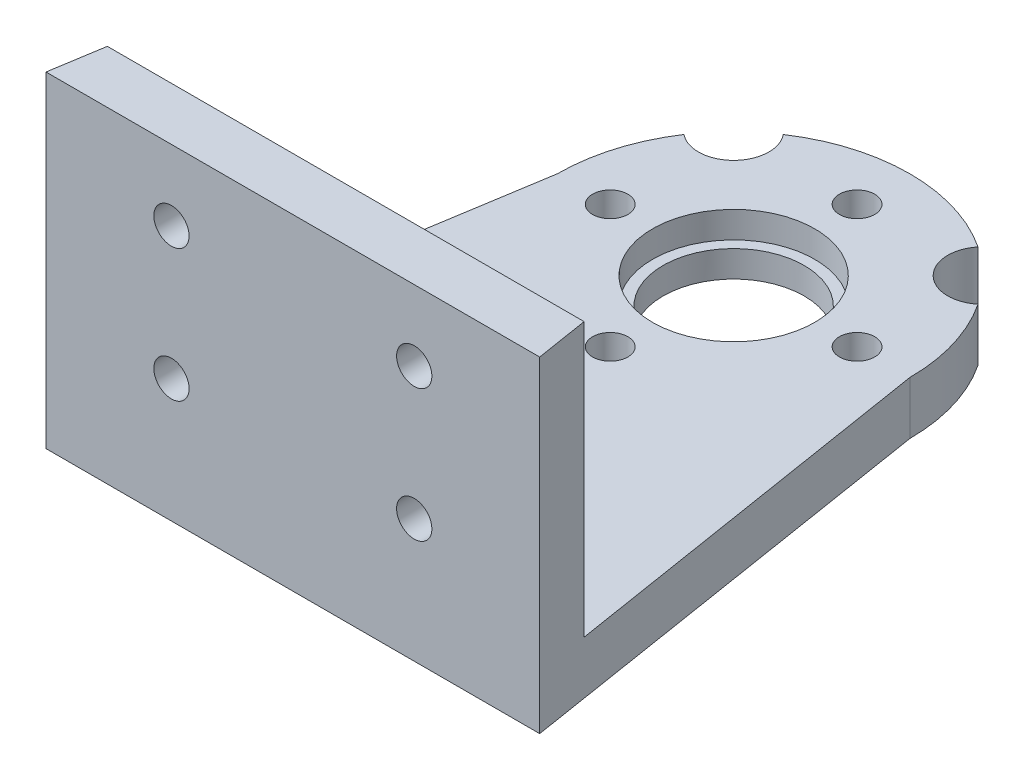
ISO-10303-21;
HEADER;
FILE_DESCRIPTION(('STEP AP214'),'2;1');
FILE_NAME('part.step','',(''),(''),'','','');
FILE_SCHEMA(('AUTOMOTIVE_DESIGN { 1 0 10303 214 1 1 1 1 }'));
ENDSEC;
DATA;
#1=APPLICATION_CONTEXT('core data for automotive mechanical design processes');
#2=APPLICATION_PROTOCOL_DEFINITION('international standard','automotive_design',2000,#1);
#3=PRODUCT_CONTEXT('',#1,'mechanical');
#4=PRODUCT('Part','Part','',(#3));
#5=PRODUCT_RELATED_PRODUCT_CATEGORY('part','',(#4));
#6=PRODUCT_DEFINITION_FORMATION('','',#4);
#7=PRODUCT_DEFINITION_CONTEXT('part definition',#1,'design');
#8=PRODUCT_DEFINITION('design','',#6,#7);
#9=PRODUCT_DEFINITION_SHAPE('','',#8);
#10=(LENGTH_UNIT() NAMED_UNIT(*) SI_UNIT(.MILLI.,.METRE.));
#11=(NAMED_UNIT(*) PLANE_ANGLE_UNIT() SI_UNIT($,.RADIAN.));
#12=(NAMED_UNIT(*) SI_UNIT($,.STERADIAN.) SOLID_ANGLE_UNIT());
#13=UNCERTAINTY_MEASURE_WITH_UNIT(LENGTH_MEASURE(1.E-05),#10,'distance_accuracy_value','');
#14=(GEOMETRIC_REPRESENTATION_CONTEXT(3) GLOBAL_UNCERTAINTY_ASSIGNED_CONTEXT((#13)) GLOBAL_UNIT_ASSIGNED_CONTEXT((#10,
#11,#12)) REPRESENTATION_CONTEXT('',''));
#15=CARTESIAN_POINT('',(0.,0.,0.));
#16=DIRECTION('',(0.,0.,1.));
#17=DIRECTION('',(1.,0.,0.));
#18=AXIS2_PLACEMENT_3D('',#15,#16,#17);
#19=CARTESIAN_POINT('',(0.,3.,0.));
#20=DIRECTION('',(0.,-1.,0.));
#21=DIRECTION('',(0.,0.,-1.));
#22=AXIS2_PLACEMENT_3D('',#19,#20,#21);
#23=CYLINDRICAL_SURFACE('',#22,10.);
#24=CARTESIAN_POINT('',(0.,0.,0.));
#25=DIRECTION('',(0.,1.,0.));
#26=DIRECTION('',(0.,0.,-1.));
#27=AXIS2_PLACEMENT_3D('',#24,#25,#26);
#28=CIRCLE('',#27,10.);
#29=CARTESIAN_POINT('',(10.,0.,0.));
#30=VERTEX_POINT('',#29);
#31=CARTESIAN_POINT('',(8.33677118357518,0.,-5.52252172768116));
#32=VERTEX_POINT('',#31);
#33=EDGE_CURVE('E219',#30,#32,#28,.T.);
#34=ORIENTED_EDGE('',*,*,#33,.T.);
#35=DIRECTION('',(0.,1.,0.));
#36=VECTOR('',#35,1.);
#37=CARTESIAN_POINT('',(8.33677118357519,-2.,-5.52252172768115));
#38=LINE('',#37,#36);
#39=CARTESIAN_POINT('',(8.33677118357519,3.,-5.52252172768115));
#40=VERTEX_POINT('',#39);
#41=EDGE_CURVE('E49',#32,#40,#38,.T.);
#42=ORIENTED_EDGE('',*,*,#41,.T.);
#43=CARTESIAN_POINT('',(0.,3.,0.));
#44=DIRECTION('',(0.,1.,0.));
#45=DIRECTION('',(0.,0.,-1.));
#46=AXIS2_PLACEMENT_3D('',#43,#44,#45);
#47=CIRCLE('',#46,10.);
#48=CARTESIAN_POINT('',(10.,3.,0.));
#49=VERTEX_POINT('',#48);
#50=EDGE_CURVE('E123',#49,#40,#47,.T.);
#51=ORIENTED_EDGE('',*,*,#50,.F.);
#52=DIRECTION('',(0.,-1.,0.));
#53=VECTOR('',#52,1.);
#54=CARTESIAN_POINT('',(10.,3.,0.));
#55=LINE('',#54,#53);
#56=EDGE_CURVE('E147',#49,#30,#55,.T.);
#57=ORIENTED_EDGE('',*,*,#56,.T.);
#58=EDGE_LOOP('',(#34,#42,#51,#57));
#59=FACE_BOUND('',#58,.T.);
#60=ADVANCED_FACE('F35',(#59),#23,.T.);
#61=CARTESIAN_POINT('',(5.52252172768112,3.,-8.33677118357521));
#62=VERTEX_POINT('',#61);
#63=CARTESIAN_POINT('',(-5.52252172768112,3.,-8.33677118357521));
#64=VERTEX_POINT('',#63);
#65=EDGE_CURVE('E120',#62,#64,#47,.T.);
#66=ORIENTED_EDGE('',*,*,#65,.F.);
#67=DIRECTION('',(0.,1.,0.));
#68=VECTOR('',#67,1.);
#69=CARTESIAN_POINT('',(5.52252172768112,-2.,-8.33677118357521));
#70=LINE('',#69,#68);
#71=CARTESIAN_POINT('',(5.52252172768113,0.,-8.3367711835752));
#72=VERTEX_POINT('',#71);
#73=EDGE_CURVE('E110',#62,#72,#70,.F.);
#74=ORIENTED_EDGE('',*,*,#73,.T.);
#75=CARTESIAN_POINT('',(-5.52252172768113,0.,-8.3367711835752));
#76=VERTEX_POINT('',#75);
#77=EDGE_CURVE('E57',#72,#76,#28,.T.);
#78=ORIENTED_EDGE('',*,*,#77,.T.);
#79=DIRECTION('',(0.,1.,0.));
#80=VECTOR('',#79,1.);
#81=CARTESIAN_POINT('',(-5.52252172768112,-2.,-8.33677118357521));
#82=LINE('',#81,#80);
#83=EDGE_CURVE('E127',#76,#64,#82,.T.);
#84=ORIENTED_EDGE('',*,*,#83,.T.);
#85=EDGE_LOOP('',(#66,#74,#78,#84));
#86=FACE_BOUND('',#85,.T.);
#87=ADVANCED_FACE('F126',(#86),#23,.T.);
#88=CARTESIAN_POINT('',(0.,-10.,0.));
#89=DIRECTION('',(0.,1.,0.));
#90=DIRECTION('',(0.,0.,1.));
#91=AXIS2_PLACEMENT_3D('',#88,#89,#90);
#92=CYLINDRICAL_SURFACE('',#91,4.);
#93=CARTESIAN_POINT('',(0.,0.,0.));
#94=DIRECTION('',(0.,-1.,0.));
#95=DIRECTION('',(0.,0.,-1.));
#96=AXIS2_PLACEMENT_3D('',#93,#94,#95);
#97=CIRCLE('',#96,4.);
#98=CARTESIAN_POINT('',(0.,0.,-4.));
#99=VERTEX_POINT('',#98);
#100=EDGE_CURVE('E215',#99,#99,#97,.T.);
#101=ORIENTED_EDGE('',*,*,#100,.T.);
#102=EDGE_LOOP('',(#101));
#103=FACE_BOUND('',#102,.T.);
#104=CARTESIAN_POINT('',(0.,1.5,0.));
#105=DIRECTION('',(0.,1.,0.));
#106=DIRECTION('',(0.,0.,1.));
#107=AXIS2_PLACEMENT_3D('',#104,#105,#106);
#108=CIRCLE('',#107,4.);
#109=CARTESIAN_POINT('',(0.,1.5,4.));
#110=VERTEX_POINT('',#109);
#111=EDGE_CURVE('E153',#110,#110,#108,.F.);
#112=ORIENTED_EDGE('',*,*,#111,.F.);
#113=EDGE_LOOP('',(#112));
#114=FACE_BOUND('',#113,.T.);
#115=ADVANCED_FACE('F351',(#103,#114),#92,.F.);
#116=CARTESIAN_POINT('',(0.,3.,0.));
#117=DIRECTION('',(0.,-1.,0.));
#118=DIRECTION('',(0.,0.,-1.));
#119=AXIS2_PLACEMENT_3D('',#116,#117,#118);
#120=PLANE('',#119);
#121=CARTESIAN_POINT('',(0.,3.,0.));
#122=DIRECTION('',(0.,1.,0.));
#123=DIRECTION('',(0.,0.,1.));
#124=AXIS2_PLACEMENT_3D('',#121,#122,#123);
#125=CIRCLE('',#124,4.6);
#126=CARTESIAN_POINT('',(0.,3.,4.6));
#127=VERTEX_POINT('',#126);
#128=EDGE_CURVE('E274',#127,#127,#125,.T.);
#129=ORIENTED_EDGE('',*,*,#128,.F.);
#130=EDGE_LOOP('',(#129));
#131=FACE_BOUND('',#130,.T.);
#132=CARTESIAN_POINT('',(-6.52,3.,19.));
#133=DIRECTION('',(0.,1.,0.));
#134=DIRECTION('',(0.,0.,1.));
#135=AXIS2_PLACEMENT_3D('',#132,#133,#134);
#136=CIRCLE('',#135,1.);
#137=CARTESIAN_POINT('',(-6.52,3.,20.));
#138=VERTEX_POINT('',#137);
#139=EDGE_CURVE('E134',#138,#138,#136,.T.);
#140=ORIENTED_EDGE('',*,*,#139,.F.);
#141=EDGE_LOOP('',(#140));
#142=FACE_BOUND('',#141,.T.);
#143=CARTESIAN_POINT('',(6.52,3.,19.));
#144=DIRECTION('',(0.,1.,0.));
#145=DIRECTION('',(0.,0.,-1.));
#146=AXIS2_PLACEMENT_3D('',#143,#144,#145);
#147=CIRCLE('',#146,1.);
#148=CARTESIAN_POINT('',(6.52,3.,18.));
#149=VERTEX_POINT('',#148);
#150=EDGE_CURVE('E188',#149,#149,#147,.T.);
#151=ORIENTED_EDGE('',*,*,#150,.F.);
#152=EDGE_LOOP('',(#151));
#153=FACE_BOUND('',#152,.T.);
#154=CARTESIAN_POINT('',(0.,3.,19.));
#155=DIRECTION('',(0.,1.,0.));
#156=DIRECTION('',(0.,0.,1.));
#157=AXIS2_PLACEMENT_3D('',#154,#155,#156);
#158=CIRCLE('',#157,1.);
#159=CARTESIAN_POINT('',(0.,3.,20.));
#160=VERTEX_POINT('',#159);
#161=EDGE_CURVE('E184',#160,#160,#158,.T.);
#162=ORIENTED_EDGE('',*,*,#161,.F.);
#163=EDGE_LOOP('',(#162));
#164=FACE_BOUND('',#163,.T.);
#165=CARTESIAN_POINT('',(0.,3.,7.));
#166=DIRECTION('',(0.,1.,0.));
#167=DIRECTION('',(0.,0.,1.));
#168=AXIS2_PLACEMENT_3D('',#165,#166,#167);
#169=CIRCLE('',#168,1.);
#170=CARTESIAN_POINT('',(0.,3.,8.));
#171=VERTEX_POINT('',#170);
#172=EDGE_CURVE('E178',#171,#171,#169,.T.);
#173=ORIENTED_EDGE('',*,*,#172,.F.);
#174=EDGE_LOOP('',(#173));
#175=FACE_BOUND('',#174,.T.);
#176=CARTESIAN_POINT('',(-7.,3.,0.));
#177=DIRECTION('',(0.,1.,0.));
#178=DIRECTION('',(0.,0.,1.));
#179=AXIS2_PLACEMENT_3D('',#176,#177,#178);
#180=CIRCLE('',#179,1.);
#181=CARTESIAN_POINT('',(-7.,3.,0.999999999999975));
#182=VERTEX_POINT('',#181);
#183=EDGE_CURVE('E172',#182,#182,#180,.T.);
#184=ORIENTED_EDGE('',*,*,#183,.F.);
#185=EDGE_LOOP('',(#184));
#186=FACE_BOUND('',#185,.T.);
#187=CARTESIAN_POINT('',(0.,3.,-7.));
#188=DIRECTION('',(0.,1.,0.));
#189=DIRECTION('',(0.,0.,1.));
#190=AXIS2_PLACEMENT_3D('',#187,#188,#189);
#191=CIRCLE('',#190,1.);
#192=CARTESIAN_POINT('',(0.,3.,-6.));
#193=VERTEX_POINT('',#192);
#194=EDGE_CURVE('E164',#193,#193,#191,.T.);
#195=ORIENTED_EDGE('',*,*,#194,.F.);
#196=EDGE_LOOP('',(#195));
#197=FACE_BOUND('',#196,.T.);
#198=CARTESIAN_POINT('',(7.,3.,0.));
#199=DIRECTION('',(0.,1.,0.));
#200=DIRECTION('',(0.,0.,1.));
#201=AXIS2_PLACEMENT_3D('',#198,#199,#200);
#202=CIRCLE('',#201,1.);
#203=CARTESIAN_POINT('',(7.,3.,1.00000000000007));
#204=VERTEX_POINT('',#203);
#205=EDGE_CURVE('E165',#204,#204,#202,.T.);
#206=ORIENTED_EDGE('',*,*,#205,.F.);
#207=EDGE_LOOP('',(#206));
#208=FACE_BOUND('',#207,.T.);
#209=ORIENTED_EDGE('',*,*,#50,.T.);
#210=CARTESIAN_POINT('',(7.07106781186546,3.,-7.07106781186549));
#211=DIRECTION('',(0.,1.,0.));
#212=DIRECTION('',(0.,0.,-1.));
#213=AXIS2_PLACEMENT_3D('',#210,#211,#212);
#214=CIRCLE('',#213,2.);
#215=EDGE_CURVE('E113',#62,#40,#214,.T.);
#216=ORIENTED_EDGE('',*,*,#215,.F.);
#217=ORIENTED_EDGE('',*,*,#65,.T.);
#218=CARTESIAN_POINT('',(-7.07106781186546,3.,-7.07106781186549));
#219=DIRECTION('',(0.,1.,0.));
#220=DIRECTION('',(0.,0.,1.));
#221=AXIS2_PLACEMENT_3D('',#218,#219,#220);
#222=CIRCLE('',#221,2.);
#223=CARTESIAN_POINT('',(-8.33677118357519,3.,-5.52252172768115));
#224=VERTEX_POINT('',#223);
#225=EDGE_CURVE('E282',#224,#64,#222,.T.);
#226=ORIENTED_EDGE('',*,*,#225,.F.);
#227=CARTESIAN_POINT('',(-10.,3.,0.));
#228=VERTEX_POINT('',#227);
#229=EDGE_CURVE('E128',#224,#228,#47,.T.);
#230=ORIENTED_EDGE('',*,*,#229,.T.);
#231=DIRECTION('',(-0.157990501106673,0.,0.987440631916705));
#232=VECTOR('',#231,1.);
#233=CARTESIAN_POINT('',(-10.,3.,0.));
#234=LINE('',#233,#232);
#235=CARTESIAN_POINT('',(-13.52,3.,22.));
#236=VERTEX_POINT('',#235);
#237=EDGE_CURVE('E130',#228,#236,#234,.T.);
#238=ORIENTED_EDGE('',*,*,#237,.T.);
#239=DIRECTION('',(-1.,0.,0.));
#240=VECTOR('',#239,1.);
#241=CARTESIAN_POINT('',(-13.52,3.,22.));
#242=LINE('',#241,#240);
#243=CARTESIAN_POINT('',(13.52,3.,22.));
#244=VERTEX_POINT('',#243);
#245=EDGE_CURVE('E148',#244,#236,#242,.T.);
#246=ORIENTED_EDGE('',*,*,#245,.F.);
#247=DIRECTION('',(-0.157990501106673,0.,-0.987440631916705));
#248=VECTOR('',#247,1.);
#249=CARTESIAN_POINT('',(10.,3.,0.));
#250=LINE('',#249,#248);
#251=EDGE_CURVE('E143',#244,#49,#250,.T.);
#252=ORIENTED_EDGE('',*,*,#251,.T.);
#253=EDGE_LOOP('',(#209,#216,#217,#226,#230,#238,#246,#252));
#254=FACE_BOUND('',#253,.T.);
#255=ADVANCED_FACE('F118',(#131,#142,#153,#164,#175,#186,#197,#208,#254),#120,.F.);
#256=ORIENTED_EDGE('',*,*,#229,.F.);
#257=DIRECTION('',(0.,1.,0.));
#258=VECTOR('',#257,1.);
#259=CARTESIAN_POINT('',(-8.33677118357519,-2.,-5.52252172768115));
#260=LINE('',#259,#258);
#261=CARTESIAN_POINT('',(-8.33677118357518,0.,-5.52252172768116));
#262=VERTEX_POINT('',#261);
#263=EDGE_CURVE('E280',#224,#262,#260,.F.);
#264=ORIENTED_EDGE('',*,*,#263,.T.);
#265=CARTESIAN_POINT('',(-10.,0.,0.));
#266=VERTEX_POINT('',#265);
#267=EDGE_CURVE('E217',#262,#266,#28,.T.);
#268=ORIENTED_EDGE('',*,*,#267,.T.);
#269=DIRECTION('',(0.,-1.,0.));
#270=VECTOR('',#269,1.);
#271=CARTESIAN_POINT('',(-10.,3.,0.));
#272=LINE('',#271,#270);
#273=EDGE_CURVE('E222',#228,#266,#272,.T.);
#274=ORIENTED_EDGE('',*,*,#273,.F.);
#275=EDGE_LOOP('',(#256,#264,#268,#274));
#276=FACE_BOUND('',#275,.T.);
#277=ADVANCED_FACE('F37',(#276),#23,.T.);
#278=CARTESIAN_POINT('',(-10.,3.,0.));
#279=DIRECTION('',(0.987440631916705,0.,0.157990501106673));
#280=DIRECTION('',(0.157990501106673,0.,-0.987440631916705));
#281=AXIS2_PLACEMENT_3D('',#278,#279,#280);
#282=PLANE('',#281);
#283=DIRECTION('',(-0.157990501106673,0.,0.987440631916705));
#284=VECTOR('',#283,1.);
#285=CARTESIAN_POINT('',(-10.,0.,0.));
#286=LINE('',#285,#284);
#287=CARTESIAN_POINT('',(-14.,0.,25.));
#288=VERTEX_POINT('',#287);
#289=EDGE_CURVE('E236',#266,#288,#286,.T.);
#290=ORIENTED_EDGE('',*,*,#289,.T.);
#291=DIRECTION('',(0.,-1.,0.));
#292=VECTOR('',#291,1.);
#293=CARTESIAN_POINT('',(-14.,3.,25.));
#294=LINE('',#293,#292);
#295=CARTESIAN_POINT('',(-14.,18.5,25.));
#296=VERTEX_POINT('',#295);
#297=EDGE_CURVE('E225',#296,#288,#294,.T.);
#298=ORIENTED_EDGE('',*,*,#297,.F.);
#299=DIRECTION('',(-0.157990501106673,0.,0.987440631916705));
#300=VECTOR('',#299,1.);
#301=CARTESIAN_POINT('',(-13.52,18.5,22.));
#302=LINE('',#301,#300);
#303=CARTESIAN_POINT('',(-13.52,18.5,22.));
#304=VERTEX_POINT('',#303);
#305=EDGE_CURVE('E152',#304,#296,#302,.T.);
#306=ORIENTED_EDGE('',*,*,#305,.F.);
#307=DIRECTION('',(0.,-1.,0.));
#308=VECTOR('',#307,1.);
#309=CARTESIAN_POINT('',(-13.52,18.5,22.));
#310=LINE('',#309,#308);
#311=EDGE_CURVE('E154',#304,#236,#310,.T.);
#312=ORIENTED_EDGE('',*,*,#311,.T.);
#313=ORIENTED_EDGE('',*,*,#237,.F.);
#314=ORIENTED_EDGE('',*,*,#273,.T.);
#315=EDGE_LOOP('',(#290,#298,#306,#312,#313,#314));
#316=FACE_BOUND('',#315,.T.);
#317=ADVANCED_FACE('F328',(#316),#282,.F.);
#318=CARTESIAN_POINT('',(-14.,3.,25.));
#319=DIRECTION('',(0.,0.,-1.));
#320=DIRECTION('',(-1.,0.,0.));
#321=AXIS2_PLACEMENT_3D('',#318,#319,#320);
#322=PLANE('',#321);
#323=CARTESIAN_POINT('',(6.885,14.5,25.));
#324=DIRECTION('',(0.,0.,-1.));
#325=DIRECTION('',(-1.,0.,0.));
#326=AXIS2_PLACEMENT_3D('',#323,#324,#325);
#327=CIRCLE('',#326,1.);
#328=CARTESIAN_POINT('',(5.885,14.5,25.));
#329=VERTEX_POINT('',#328);
#330=EDGE_CURVE('E290',#329,#329,#327,.T.);
#331=ORIENTED_EDGE('',*,*,#330,.T.);
#332=EDGE_LOOP('',(#331));
#333=FACE_BOUND('',#332,.T.);
#334=CARTESIAN_POINT('',(-6.88500000000008,7.,25.));
#335=DIRECTION('',(0.,0.,-1.));
#336=DIRECTION('',(-1.,0.,0.));
#337=AXIS2_PLACEMENT_3D('',#334,#335,#336);
#338=CIRCLE('',#337,1.);
#339=CARTESIAN_POINT('',(-7.88500000000008,7.,25.));
#340=VERTEX_POINT('',#339);
#341=EDGE_CURVE('E293',#340,#340,#338,.T.);
#342=ORIENTED_EDGE('',*,*,#341,.T.);
#343=EDGE_LOOP('',(#342));
#344=FACE_BOUND('',#343,.T.);
#345=CARTESIAN_POINT('',(6.88499999999992,7.,25.));
#346=DIRECTION('',(0.,0.,-1.));
#347=DIRECTION('',(-1.,0.,0.));
#348=AXIS2_PLACEMENT_3D('',#345,#346,#347);
#349=CIRCLE('',#348,1.);
#350=CARTESIAN_POINT('',(5.88499999999992,7.,25.));
#351=VERTEX_POINT('',#350);
#352=EDGE_CURVE('E296',#351,#351,#349,.T.);
#353=ORIENTED_EDGE('',*,*,#352,.T.);
#354=EDGE_LOOP('',(#353));
#355=FACE_BOUND('',#354,.T.);
#356=CARTESIAN_POINT('',(-6.885,14.5,25.));
#357=DIRECTION('',(0.,0.,-1.));
#358=DIRECTION('',(-1.,0.,0.));
#359=AXIS2_PLACEMENT_3D('',#356,#357,#358);
#360=CIRCLE('',#359,1.);
#361=CARTESIAN_POINT('',(-7.88500000000001,14.5,25.));
#362=VERTEX_POINT('',#361);
#363=EDGE_CURVE('E124',#362,#362,#360,.T.);
#364=ORIENTED_EDGE('',*,*,#363,.T.);
#365=EDGE_LOOP('',(#364));
#366=FACE_BOUND('',#365,.T.);
#367=DIRECTION('',(1.,0.,0.));
#368=VECTOR('',#367,1.);
#369=CARTESIAN_POINT('',(-14.,0.,25.));
#370=LINE('',#369,#368);
#371=CARTESIAN_POINT('',(14.,0.,25.));
#372=VERTEX_POINT('',#371);
#373=EDGE_CURVE('E234',#288,#372,#370,.T.);
#374=ORIENTED_EDGE('',*,*,#373,.T.);
#375=DIRECTION('',(0.,-1.,0.));
#376=VECTOR('',#375,1.);
#377=CARTESIAN_POINT('',(14.,3.,25.));
#378=LINE('',#377,#376);
#379=CARTESIAN_POINT('',(14.,18.5,25.));
#380=VERTEX_POINT('',#379);
#381=EDGE_CURVE('E228',#380,#372,#378,.T.);
#382=ORIENTED_EDGE('',*,*,#381,.F.);
#383=DIRECTION('',(1.,0.,0.));
#384=VECTOR('',#383,1.);
#385=CARTESIAN_POINT('',(-14.,18.5,25.));
#386=LINE('',#385,#384);
#387=EDGE_CURVE('E268',#296,#380,#386,.T.);
#388=ORIENTED_EDGE('',*,*,#387,.F.);
#389=ORIENTED_EDGE('',*,*,#297,.T.);
#390=EDGE_LOOP('',(#374,#382,#388,#389));
#391=FACE_BOUND('',#390,.T.);
#392=ADVANCED_FACE('F327',(#333,#344,#355,#366,#391),#322,.F.);
#393=CARTESIAN_POINT('',(10.,3.,0.));
#394=DIRECTION('',(-0.987440631916705,0.,0.157990501106673));
#395=DIRECTION('',(0.157990501106673,0.,0.987440631916705));
#396=AXIS2_PLACEMENT_3D('',#393,#394,#395);
#397=PLANE('',#396);
#398=DIRECTION('',(-0.157990501106673,0.,-0.987440631916705));
#399=VECTOR('',#398,1.);
#400=CARTESIAN_POINT('',(10.,0.,0.));
#401=LINE('',#400,#399);
#402=EDGE_CURVE('E131',#372,#30,#401,.T.);
#403=ORIENTED_EDGE('',*,*,#402,.T.);
#404=ORIENTED_EDGE('',*,*,#56,.F.);
#405=ORIENTED_EDGE('',*,*,#251,.F.);
#406=DIRECTION('',(0.,-1.,0.));
#407=VECTOR('',#406,1.);
#408=CARTESIAN_POINT('',(13.52,18.5,22.));
#409=LINE('',#408,#407);
#410=CARTESIAN_POINT('',(13.52,18.5,22.));
#411=VERTEX_POINT('',#410);
#412=EDGE_CURVE('E168',#411,#244,#409,.T.);
#413=ORIENTED_EDGE('',*,*,#412,.F.);
#414=DIRECTION('',(-0.157990501106673,0.,-0.987440631916705));
#415=VECTOR('',#414,1.);
#416=CARTESIAN_POINT('',(14.,18.5,25.));
#417=LINE('',#416,#415);
#418=EDGE_CURVE('E265',#380,#411,#417,.T.);
#419=ORIENTED_EDGE('',*,*,#418,.F.);
#420=ORIENTED_EDGE('',*,*,#381,.T.);
#421=EDGE_LOOP('',(#403,#404,#405,#413,#419,#420));
#422=FACE_BOUND('',#421,.T.);
#423=ADVANCED_FACE('F204',(#422),#397,.F.);
#424=CARTESIAN_POINT('',(0.,0.,0.));
#425=DIRECTION('',(0.,-1.,0.));
#426=DIRECTION('',(0.,0.,-1.));
#427=AXIS2_PLACEMENT_3D('',#424,#425,#426);
#428=PLANE('',#427);
#429=CARTESIAN_POINT('',(7.07106781186546,0.,-7.07106781186549));
#430=DIRECTION('',(0.,-1.,0.));
#431=DIRECTION('',(0.,0.,-1.));
#432=AXIS2_PLACEMENT_3D('',#429,#430,#431);
#433=CIRCLE('',#432,2.);
#434=EDGE_CURVE('E11',#32,#72,#433,.T.);
#435=ORIENTED_EDGE('',*,*,#434,.F.);
#436=ORIENTED_EDGE('',*,*,#33,.F.);
#437=ORIENTED_EDGE('',*,*,#402,.F.);
#438=ORIENTED_EDGE('',*,*,#373,.F.);
#439=ORIENTED_EDGE('',*,*,#289,.F.);
#440=ORIENTED_EDGE('',*,*,#267,.F.);
#441=CARTESIAN_POINT('',(-7.07106781186546,0.,-7.07106781186549));
#442=DIRECTION('',(0.,-1.,0.));
#443=DIRECTION('',(0.,0.,-1.));
#444=AXIS2_PLACEMENT_3D('',#441,#442,#443);
#445=CIRCLE('',#444,2.);
#446=EDGE_CURVE('E43',#76,#262,#445,.T.);
#447=ORIENTED_EDGE('',*,*,#446,.F.);
#448=ORIENTED_EDGE('',*,*,#77,.F.);
#449=EDGE_LOOP('',(#435,#436,#437,#438,#439,#440,#447,#448));
#450=FACE_BOUND('',#449,.T.);
#451=CARTESIAN_POINT('',(7.,0.,0.));
#452=DIRECTION('',(0.,1.,0.));
#453=DIRECTION('',(0.,0.,1.));
#454=AXIS2_PLACEMENT_3D('',#451,#452,#453);
#455=CIRCLE('',#454,1.);
#456=CARTESIAN_POINT('',(7.,0.,1.00000000000007));
#457=VERTEX_POINT('',#456);
#458=EDGE_CURVE('E161',#457,#457,#455,.T.);
#459=ORIENTED_EDGE('',*,*,#458,.T.);
#460=EDGE_LOOP('',(#459));
#461=FACE_BOUND('',#460,.T.);
#462=CARTESIAN_POINT('',(0.,0.,-7.));
#463=DIRECTION('',(0.,1.,0.));
#464=DIRECTION('',(0.,0.,1.));
#465=AXIS2_PLACEMENT_3D('',#462,#463,#464);
#466=CIRCLE('',#465,1.);
#467=CARTESIAN_POINT('',(0.,0.,-6.));
#468=VERTEX_POINT('',#467);
#469=EDGE_CURVE('E169',#468,#468,#466,.T.);
#470=ORIENTED_EDGE('',*,*,#469,.T.);
#471=EDGE_LOOP('',(#470));
#472=FACE_BOUND('',#471,.T.);
#473=CARTESIAN_POINT('',(-7.,0.,0.));
#474=DIRECTION('',(0.,1.,0.));
#475=DIRECTION('',(0.,0.,1.));
#476=AXIS2_PLACEMENT_3D('',#473,#474,#475);
#477=CIRCLE('',#476,1.);
#478=CARTESIAN_POINT('',(-7.,0.,0.999999999999975));
#479=VERTEX_POINT('',#478);
#480=EDGE_CURVE('E175',#479,#479,#477,.T.);
#481=ORIENTED_EDGE('',*,*,#480,.T.);
#482=EDGE_LOOP('',(#481));
#483=FACE_BOUND('',#482,.T.);
#484=CARTESIAN_POINT('',(0.,0.,7.));
#485=DIRECTION('',(0.,1.,0.));
#486=DIRECTION('',(0.,0.,1.));
#487=AXIS2_PLACEMENT_3D('',#484,#485,#486);
#488=CIRCLE('',#487,1.);
#489=CARTESIAN_POINT('',(0.,0.,8.));
#490=VERTEX_POINT('',#489);
#491=EDGE_CURVE('E181',#490,#490,#488,.T.);
#492=ORIENTED_EDGE('',*,*,#491,.T.);
#493=EDGE_LOOP('',(#492));
#494=FACE_BOUND('',#493,.T.);
#495=CARTESIAN_POINT('',(0.,0.,19.));
#496=DIRECTION('',(0.,-1.,0.));
#497=DIRECTION('',(0.,0.,-1.));
#498=AXIS2_PLACEMENT_3D('',#495,#496,#497);
#499=CIRCLE('',#498,1.);
#500=CARTESIAN_POINT('',(0.,0.,18.));
#501=VERTEX_POINT('',#500);
#502=EDGE_CURVE('E144',#501,#501,#499,.T.);
#503=ORIENTED_EDGE('',*,*,#502,.F.);
#504=EDGE_LOOP('',(#503));
#505=FACE_BOUND('',#504,.T.);
#506=CARTESIAN_POINT('',(6.52,0.,19.));
#507=DIRECTION('',(0.,-1.,0.));
#508=DIRECTION('',(0.,0.,-1.));
#509=AXIS2_PLACEMENT_3D('',#506,#507,#508);
#510=CIRCLE('',#509,1.);
#511=CARTESIAN_POINT('',(6.52,0.,18.));
#512=VERTEX_POINT('',#511);
#513=EDGE_CURVE('E190',#512,#512,#510,.T.);
#514=ORIENTED_EDGE('',*,*,#513,.F.);
#515=EDGE_LOOP('',(#514));
#516=FACE_BOUND('',#515,.T.);
#517=CARTESIAN_POINT('',(-6.52,0.,19.));
#518=DIRECTION('',(0.,-1.,0.));
#519=DIRECTION('',(0.,0.,-1.));
#520=AXIS2_PLACEMENT_3D('',#517,#518,#519);
#521=CIRCLE('',#520,1.);
#522=CARTESIAN_POINT('',(-6.52,0.,18.));
#523=VERTEX_POINT('',#522);
#524=EDGE_CURVE('E212',#523,#523,#521,.T.);
#525=ORIENTED_EDGE('',*,*,#524,.F.);
#526=EDGE_LOOP('',(#525));
#527=FACE_BOUND('',#526,.T.);
#528=ORIENTED_EDGE('',*,*,#100,.F.);
#529=EDGE_LOOP('',(#528));
#530=FACE_BOUND('',#529,.T.);
#531=ADVANCED_FACE('F200',(#450,#461,#472,#483,#494,#505,#516,#527,#530),#428,.T.);
#532=CARTESIAN_POINT('',(-6.52,-10.,19.));
#533=DIRECTION('',(0.,1.,0.));
#534=DIRECTION('',(0.,0.,1.));
#535=AXIS2_PLACEMENT_3D('',#532,#533,#534);
#536=CYLINDRICAL_SURFACE('',#535,1.);
#537=ORIENTED_EDGE('',*,*,#524,.T.);
#538=EDGE_LOOP('',(#537));
#539=FACE_BOUND('',#538,.T.);
#540=ORIENTED_EDGE('',*,*,#139,.T.);
#541=EDGE_LOOP('',(#540));
#542=FACE_BOUND('',#541,.T.);
#543=ADVANCED_FACE('F203',(#539,#542),#536,.F.);
#544=CARTESIAN_POINT('',(6.52,-10.,19.));
#545=DIRECTION('',(0.,1.,0.));
#546=DIRECTION('',(0.,0.,1.));
#547=AXIS2_PLACEMENT_3D('',#544,#545,#546);
#548=CYLINDRICAL_SURFACE('',#547,1.);
#549=ORIENTED_EDGE('',*,*,#513,.T.);
#550=EDGE_LOOP('',(#549));
#551=FACE_BOUND('',#550,.T.);
#552=ORIENTED_EDGE('',*,*,#150,.T.);
#553=EDGE_LOOP('',(#552));
#554=FACE_BOUND('',#553,.T.);
#555=ADVANCED_FACE('F476',(#551,#554),#548,.F.);
#556=CARTESIAN_POINT('',(0.,-10.,19.));
#557=DIRECTION('',(0.,1.,0.));
#558=DIRECTION('',(0.,0.,1.));
#559=AXIS2_PLACEMENT_3D('',#556,#557,#558);
#560=CYLINDRICAL_SURFACE('',#559,1.);
#561=ORIENTED_EDGE('',*,*,#502,.T.);
#562=EDGE_LOOP('',(#561));
#563=FACE_BOUND('',#562,.T.);
#564=ORIENTED_EDGE('',*,*,#161,.T.);
#565=EDGE_LOOP('',(#564));
#566=FACE_BOUND('',#565,.T.);
#567=ADVANCED_FACE('F197',(#563,#566),#560,.F.);
#568=CARTESIAN_POINT('',(0.,0.,7.));
#569=DIRECTION('',(0.,1.,0.));
#570=DIRECTION('',(0.,0.,1.));
#571=AXIS2_PLACEMENT_3D('',#568,#569,#570);
#572=CYLINDRICAL_SURFACE('',#571,1.);
#573=ORIENTED_EDGE('',*,*,#491,.F.);
#574=EDGE_LOOP('',(#573));
#575=FACE_BOUND('',#574,.T.);
#576=ORIENTED_EDGE('',*,*,#172,.T.);
#577=EDGE_LOOP('',(#576));
#578=FACE_BOUND('',#577,.T.);
#579=ADVANCED_FACE('F489',(#575,#578),#572,.F.);
#580=CARTESIAN_POINT('',(-7.,0.,0.));
#581=DIRECTION('',(0.,1.,0.));
#582=DIRECTION('',(0.,0.,1.));
#583=AXIS2_PLACEMENT_3D('',#580,#581,#582);
#584=CYLINDRICAL_SURFACE('',#583,1.);
#585=ORIENTED_EDGE('',*,*,#480,.F.);
#586=EDGE_LOOP('',(#585));
#587=FACE_BOUND('',#586,.T.);
#588=ORIENTED_EDGE('',*,*,#183,.T.);
#589=EDGE_LOOP('',(#588));
#590=FACE_BOUND('',#589,.T.);
#591=ADVANCED_FACE('F496',(#587,#590),#584,.F.);
#592=CARTESIAN_POINT('',(0.,0.,-7.));
#593=DIRECTION('',(0.,1.,0.));
#594=DIRECTION('',(0.,0.,1.));
#595=AXIS2_PLACEMENT_3D('',#592,#593,#594);
#596=CYLINDRICAL_SURFACE('',#595,1.);
#597=ORIENTED_EDGE('',*,*,#469,.F.);
#598=EDGE_LOOP('',(#597));
#599=FACE_BOUND('',#598,.T.);
#600=ORIENTED_EDGE('',*,*,#194,.T.);
#601=EDGE_LOOP('',(#600));
#602=FACE_BOUND('',#601,.T.);
#603=ADVANCED_FACE('F504',(#599,#602),#596,.F.);
#604=CARTESIAN_POINT('',(7.,0.,0.));
#605=DIRECTION('',(0.,1.,0.));
#606=DIRECTION('',(0.,0.,1.));
#607=AXIS2_PLACEMENT_3D('',#604,#605,#606);
#608=CYLINDRICAL_SURFACE('',#607,1.);
#609=ORIENTED_EDGE('',*,*,#458,.F.);
#610=EDGE_LOOP('',(#609));
#611=FACE_BOUND('',#610,.T.);
#612=ORIENTED_EDGE('',*,*,#205,.T.);
#613=EDGE_LOOP('',(#612));
#614=FACE_BOUND('',#613,.T.);
#615=ADVANCED_FACE('F316',(#611,#614),#608,.F.);
#616=CARTESIAN_POINT('',(-13.52,18.5,22.));
#617=DIRECTION('',(0.,0.,1.));
#618=DIRECTION('',(1.,0.,0.));
#619=AXIS2_PLACEMENT_3D('',#616,#617,#618);
#620=PLANE('',#619);
#621=CARTESIAN_POINT('',(6.885,14.5,22.));
#622=DIRECTION('',(0.,0.,-1.));
#623=DIRECTION('',(-1.,0.,0.));
#624=AXIS2_PLACEMENT_3D('',#621,#622,#623);
#625=CIRCLE('',#624,1.);
#626=CARTESIAN_POINT('',(5.885,14.5,22.));
#627=VERTEX_POINT('',#626);
#628=EDGE_CURVE('E299',#627,#627,#625,.T.);
#629=ORIENTED_EDGE('',*,*,#628,.F.);
#630=EDGE_LOOP('',(#629));
#631=FACE_BOUND('',#630,.T.);
#632=CARTESIAN_POINT('',(-6.88500000000008,7.,22.));
#633=DIRECTION('',(0.,0.,-1.));
#634=DIRECTION('',(-1.,0.,0.));
#635=AXIS2_PLACEMENT_3D('',#632,#633,#634);
#636=CIRCLE('',#635,1.);
#637=CARTESIAN_POINT('',(-7.88500000000008,7.,22.));
#638=VERTEX_POINT('',#637);
#639=EDGE_CURVE('E303',#638,#638,#636,.T.);
#640=ORIENTED_EDGE('',*,*,#639,.F.);
#641=EDGE_LOOP('',(#640));
#642=FACE_BOUND('',#641,.T.);
#643=CARTESIAN_POINT('',(6.88499999999992,7.,22.));
#644=DIRECTION('',(0.,0.,-1.));
#645=DIRECTION('',(-1.,0.,0.));
#646=AXIS2_PLACEMENT_3D('',#643,#644,#645);
#647=CIRCLE('',#646,1.);
#648=CARTESIAN_POINT('',(5.88499999999992,7.,22.));
#649=VERTEX_POINT('',#648);
#650=EDGE_CURVE('E300',#649,#649,#647,.T.);
#651=ORIENTED_EDGE('',*,*,#650,.F.);
#652=EDGE_LOOP('',(#651));
#653=FACE_BOUND('',#652,.T.);
#654=CARTESIAN_POINT('',(-6.885,14.5,22.));
#655=DIRECTION('',(0.,0.,-1.));
#656=DIRECTION('',(-1.,0.,0.));
#657=AXIS2_PLACEMENT_3D('',#654,#655,#656);
#658=CIRCLE('',#657,1.);
#659=CARTESIAN_POINT('',(-7.88500000000001,14.5,22.));
#660=VERTEX_POINT('',#659);
#661=EDGE_CURVE('E287',#660,#660,#658,.T.);
#662=ORIENTED_EDGE('',*,*,#661,.F.);
#663=EDGE_LOOP('',(#662));
#664=FACE_BOUND('',#663,.T.);
#665=ORIENTED_EDGE('',*,*,#245,.T.);
#666=ORIENTED_EDGE('',*,*,#311,.F.);
#667=DIRECTION('',(-1.,0.,0.));
#668=VECTOR('',#667,1.);
#669=CARTESIAN_POINT('',(-13.52,18.5,22.));
#670=LINE('',#669,#668);
#671=EDGE_CURVE('E159',#411,#304,#670,.T.);
#672=ORIENTED_EDGE('',*,*,#671,.F.);
#673=ORIENTED_EDGE('',*,*,#412,.T.);
#674=EDGE_LOOP('',(#665,#666,#672,#673));
#675=FACE_BOUND('',#674,.T.);
#676=ADVANCED_FACE('F312',(#631,#642,#653,#664,#675),#620,.F.);
#677=CARTESIAN_POINT('',(0.,18.5,0.));
#678=DIRECTION('',(0.,1.,0.));
#679=DIRECTION('',(0.,0.,1.));
#680=AXIS2_PLACEMENT_3D('',#677,#678,#679);
#681=PLANE('',#680);
#682=ORIENTED_EDGE('',*,*,#305,.T.);
#683=ORIENTED_EDGE('',*,*,#387,.T.);
#684=ORIENTED_EDGE('',*,*,#418,.T.);
#685=ORIENTED_EDGE('',*,*,#671,.T.);
#686=EDGE_LOOP('',(#682,#683,#684,#685));
#687=FACE_BOUND('',#686,.T.);
#688=ADVANCED_FACE('F315',(#687),#681,.T.);
#689=CARTESIAN_POINT('',(0.,1.5,0.));
#690=DIRECTION('',(0.,1.,0.));
#691=DIRECTION('',(0.,0.,1.));
#692=AXIS2_PLACEMENT_3D('',#689,#690,#691);
#693=PLANE('',#692);
#694=CARTESIAN_POINT('',(0.,1.5,0.));
#695=DIRECTION('',(0.,1.,0.));
#696=DIRECTION('',(0.,0.,1.));
#697=AXIS2_PLACEMENT_3D('',#694,#695,#696);
#698=CIRCLE('',#697,4.6);
#699=CARTESIAN_POINT('',(0.,1.5,4.6));
#700=VERTEX_POINT('',#699);
#701=EDGE_CURVE('E252',#700,#700,#698,.T.);
#702=ORIENTED_EDGE('',*,*,#701,.T.);
#703=EDGE_LOOP('',(#702));
#704=FACE_BOUND('',#703,.T.);
#705=ORIENTED_EDGE('',*,*,#111,.T.);
#706=EDGE_LOOP('',(#705));
#707=FACE_BOUND('',#706,.T.);
#708=ADVANCED_FACE('F343',(#704,#707),#693,.T.);
#709=CARTESIAN_POINT('',(0.,1.5,0.));
#710=DIRECTION('',(0.,1.,0.));
#711=DIRECTION('',(0.,0.,1.));
#712=AXIS2_PLACEMENT_3D('',#709,#710,#711);
#713=CYLINDRICAL_SURFACE('',#712,4.6);
#714=ORIENTED_EDGE('',*,*,#701,.F.);
#715=EDGE_LOOP('',(#714));
#716=FACE_BOUND('',#715,.T.);
#717=ORIENTED_EDGE('',*,*,#128,.T.);
#718=EDGE_LOOP('',(#717));
#719=FACE_BOUND('',#718,.T.);
#720=ADVANCED_FACE('F334',(#716,#719),#713,.F.);
#721=CARTESIAN_POINT('',(-7.07106781186546,-7.,-7.07106781186549));
#722=DIRECTION('',(0.,1.,0.));
#723=DIRECTION('',(0.,0.,1.));
#724=AXIS2_PLACEMENT_3D('',#721,#722,#723);
#725=CYLINDRICAL_SURFACE('',#724,2.);
#726=ORIENTED_EDGE('',*,*,#446,.T.);
#727=ORIENTED_EDGE('',*,*,#263,.F.);
#728=ORIENTED_EDGE('',*,*,#225,.T.);
#729=ORIENTED_EDGE('',*,*,#83,.F.);
#730=EDGE_LOOP('',(#726,#727,#728,#729));
#731=FACE_BOUND('',#730,.T.);
#732=ADVANCED_FACE('F332',(#731),#725,.F.);
#733=CARTESIAN_POINT('',(7.07106781186546,-7.,-7.07106781186549));
#734=DIRECTION('',(0.,1.,0.));
#735=DIRECTION('',(0.,0.,1.));
#736=AXIS2_PLACEMENT_3D('',#733,#734,#735);
#737=CYLINDRICAL_SURFACE('',#736,2.);
#738=ORIENTED_EDGE('',*,*,#434,.T.);
#739=ORIENTED_EDGE('',*,*,#73,.F.);
#740=ORIENTED_EDGE('',*,*,#215,.T.);
#741=ORIENTED_EDGE('',*,*,#41,.F.);
#742=EDGE_LOOP('',(#738,#739,#740,#741));
#743=FACE_BOUND('',#742,.T.);
#744=ADVANCED_FACE('F112',(#743),#737,.F.);
#745=CARTESIAN_POINT('',(-6.885,14.5,32.));
#746=DIRECTION('',(0.,0.,-1.));
#747=DIRECTION('',(-1.,0.,0.));
#748=AXIS2_PLACEMENT_3D('',#745,#746,#747);
#749=CYLINDRICAL_SURFACE('',#748,1.);
#750=ORIENTED_EDGE('',*,*,#661,.T.);
#751=EDGE_LOOP('',(#750));
#752=FACE_BOUND('',#751,.T.);
#753=ORIENTED_EDGE('',*,*,#363,.F.);
#754=EDGE_LOOP('',(#753));
#755=FACE_BOUND('',#754,.T.);
#756=ADVANCED_FACE('F340',(#752,#755),#749,.F.);
#757=CARTESIAN_POINT('',(6.88499999999992,7.,32.));
#758=DIRECTION('',(0.,0.,-1.));
#759=DIRECTION('',(-1.,0.,0.));
#760=AXIS2_PLACEMENT_3D('',#757,#758,#759);
#761=CYLINDRICAL_SURFACE('',#760,1.);
#762=ORIENTED_EDGE('',*,*,#650,.T.);
#763=EDGE_LOOP('',(#762));
#764=FACE_BOUND('',#763,.T.);
#765=ORIENTED_EDGE('',*,*,#352,.F.);
#766=EDGE_LOOP('',(#765));
#767=FACE_BOUND('',#766,.T.);
#768=ADVANCED_FACE('F383',(#764,#767),#761,.F.);
#769=CARTESIAN_POINT('',(-6.88500000000008,7.,32.));
#770=DIRECTION('',(0.,0.,-1.));
#771=DIRECTION('',(-1.,0.,0.));
#772=AXIS2_PLACEMENT_3D('',#769,#770,#771);
#773=CYLINDRICAL_SURFACE('',#772,1.);
#774=ORIENTED_EDGE('',*,*,#639,.T.);
#775=EDGE_LOOP('',(#774));
#776=FACE_BOUND('',#775,.T.);
#777=ORIENTED_EDGE('',*,*,#341,.F.);
#778=EDGE_LOOP('',(#777));
#779=FACE_BOUND('',#778,.T.);
#780=ADVANCED_FACE('F389',(#776,#779),#773,.F.);
#781=CARTESIAN_POINT('',(6.885,14.5,32.));
#782=DIRECTION('',(0.,0.,-1.));
#783=DIRECTION('',(-1.,0.,0.));
#784=AXIS2_PLACEMENT_3D('',#781,#782,#783);
#785=CYLINDRICAL_SURFACE('',#784,1.);
#786=ORIENTED_EDGE('',*,*,#628,.T.);
#787=EDGE_LOOP('',(#786));
#788=FACE_BOUND('',#787,.T.);
#789=ORIENTED_EDGE('',*,*,#330,.F.);
#790=EDGE_LOOP('',(#789));
#791=FACE_BOUND('',#790,.T.);
#792=ADVANCED_FACE('F309',(#788,#791),#785,.F.);
#793=CLOSED_SHELL('',(#60,#87,#115,#255,#277,#317,#392,#423,#531,#543,#555,#567,#579,#591,#603,
#615,#676,#688,#708,#720,#732,#744,#756,#768,#780,#792));
#794=MANIFOLD_SOLID_BREP('B2',#793);
#795=ADVANCED_BREP_SHAPE_REPRESENTATION('',(#18,#794),#14);
#796=SHAPE_DEFINITION_REPRESENTATION(#9,#795);
ENDSEC;
END-ISO-10303-21;
